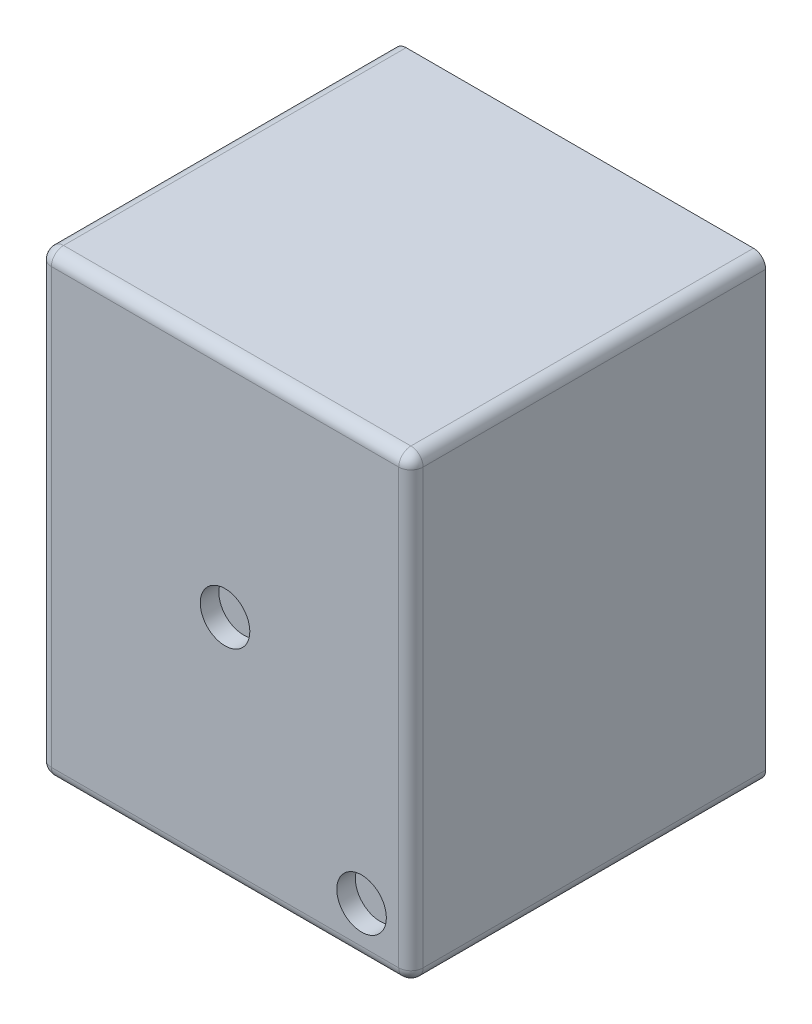
ISO-10303-21;
HEADER;
FILE_DESCRIPTION(('STEP AP214'),'2;1');
FILE_NAME('part.step','',(''),(''),'','','');
FILE_SCHEMA(('AUTOMOTIVE_DESIGN { 1 0 10303 214 1 1 1 1 }'));
ENDSEC;
DATA;
#1=APPLICATION_CONTEXT('core data for automotive mechanical design processes');
#2=APPLICATION_PROTOCOL_DEFINITION('international standard','automotive_design',2000,#1);
#3=PRODUCT_CONTEXT('',#1,'mechanical');
#4=PRODUCT('Part','Part','',(#3));
#5=PRODUCT_RELATED_PRODUCT_CATEGORY('part','',(#4));
#6=PRODUCT_DEFINITION_FORMATION('','',#4);
#7=PRODUCT_DEFINITION_CONTEXT('part definition',#1,'design');
#8=PRODUCT_DEFINITION('design','',#6,#7);
#9=PRODUCT_DEFINITION_SHAPE('','',#8);
#10=(LENGTH_UNIT() NAMED_UNIT(*) SI_UNIT(.MILLI.,.METRE.));
#11=(NAMED_UNIT(*) PLANE_ANGLE_UNIT() SI_UNIT($,.RADIAN.));
#12=(NAMED_UNIT(*) SI_UNIT($,.STERADIAN.) SOLID_ANGLE_UNIT());
#13=UNCERTAINTY_MEASURE_WITH_UNIT(LENGTH_MEASURE(1.E-05),#10,'distance_accuracy_value','');
#14=(GEOMETRIC_REPRESENTATION_CONTEXT(3) GLOBAL_UNCERTAINTY_ASSIGNED_CONTEXT((#13)) GLOBAL_UNIT_ASSIGNED_CONTEXT((#10,
#11,#12)) REPRESENTATION_CONTEXT('',''));
#15=CARTESIAN_POINT('',(0.,0.,0.));
#16=DIRECTION('',(0.,0.,1.));
#17=DIRECTION('',(1.,0.,0.));
#18=AXIS2_PLACEMENT_3D('',#15,#16,#17);
#19=CARTESIAN_POINT('',(-0.997364285309382,0.168780356945077,0.617807641667743));
#20=DIRECTION('',(0.,0.,1.));
#21=DIRECTION('',(1.,0.,0.));
#22=AXIS2_PLACEMENT_3D('',#19,#20,#21);
#23=PLANE('',#22);
#24=CARTESIAN_POINT('',(-0.997364285309382,0.168780356945077,0.617807641667743));
#25=DIRECTION('',(0.,0.,1.));
#26=DIRECTION('',(1.,0.,0.));
#27=AXIS2_PLACEMENT_3D('',#24,#25,#26);
#28=CIRCLE('',#27,0.04);
#29=CARTESIAN_POINT('',(-0.957364285309382,0.168780356945077,0.617807641667743));
#30=VERTEX_POINT('',#29);
#31=EDGE_CURVE('E20',#30,#30,#28,.T.);
#32=ORIENTED_EDGE('',*,*,#31,.T.);
#33=EDGE_LOOP('',(#32));
#34=FACE_BOUND('',#33,.T.);
#35=ADVANCED_FACE('F17',(#34),#23,.T.);
#36=CARTESIAN_POINT('',(-0.776920242454084,-0.121368087614107,0.617807641667743));
#37=DIRECTION('',(0.,0.,1.));
#38=DIRECTION('',(1.,0.,0.));
#39=AXIS2_PLACEMENT_3D('',#36,#37,#38);
#40=PLANE('',#39);
#41=CARTESIAN_POINT('',(-0.776920242454084,-0.121368087614107,0.617807641667743));
#42=DIRECTION('',(0.,0.,1.));
#43=DIRECTION('',(1.,0.,0.));
#44=AXIS2_PLACEMENT_3D('',#41,#42,#43);
#45=CIRCLE('',#44,0.04);
#46=CARTESIAN_POINT('',(-0.736920242454084,-0.121368087614107,0.617807641667743));
#47=VERTEX_POINT('',#46);
#48=EDGE_CURVE('E175',#47,#47,#45,.T.);
#49=ORIENTED_EDGE('',*,*,#48,.T.);
#50=EDGE_LOOP('',(#49));
#51=FACE_BOUND('',#50,.T.);
#52=ADVANCED_FACE('F187',(#51),#40,.T.);
#53=CARTESIAN_POINT('',(-0.997364285309382,0.168780356945077,0.647807641667743));
#54=DIRECTION('',(0.,0.,1.));
#55=DIRECTION('',(1.,0.,0.));
#56=AXIS2_PLACEMENT_3D('',#53,#54,#55);
#57=CYLINDRICAL_SURFACE('',#56,0.04);
#58=ORIENTED_EDGE('',*,*,#31,.F.);
#59=EDGE_LOOP('',(#58));
#60=FACE_BOUND('',#59,.T.);
#61=CARTESIAN_POINT('',(-0.997364285309382,0.168780356945077,0.647807641667743));
#62=DIRECTION('',(0.,0.,1.));
#63=DIRECTION('',(1.,0.,0.));
#64=AXIS2_PLACEMENT_3D('',#61,#62,#63);
#65=CIRCLE('',#64,0.04);
#66=CARTESIAN_POINT('',(-0.957364285309382,0.168780356945077,0.647807641667743));
#67=VERTEX_POINT('',#66);
#68=EDGE_CURVE('E173',#67,#67,#65,.T.);
#69=ORIENTED_EDGE('',*,*,#68,.T.);
#70=EDGE_LOOP('',(#69));
#71=FACE_BOUND('',#70,.T.);
#72=ADVANCED_FACE('F183',(#60,#71),#57,.F.);
#73=CARTESIAN_POINT('',(-0.776920242454084,-0.121368087614107,0.647807641667743));
#74=DIRECTION('',(0.,0.,1.));
#75=DIRECTION('',(1.,0.,0.));
#76=AXIS2_PLACEMENT_3D('',#73,#74,#75);
#77=CYLINDRICAL_SURFACE('',#76,0.04);
#78=ORIENTED_EDGE('',*,*,#48,.F.);
#79=EDGE_LOOP('',(#78));
#80=FACE_BOUND('',#79,.T.);
#81=CARTESIAN_POINT('',(-0.776920242454084,-0.121368087614107,0.647807641667743));
#82=DIRECTION('',(0.,0.,1.));
#83=DIRECTION('',(1.,0.,0.));
#84=AXIS2_PLACEMENT_3D('',#81,#82,#83);
#85=CIRCLE('',#84,0.04);
#86=CARTESIAN_POINT('',(-0.736920242454084,-0.121368087614107,0.647807641667743));
#87=VERTEX_POINT('',#86);
#88=EDGE_CURVE('E139',#87,#87,#85,.T.);
#89=ORIENTED_EDGE('',*,*,#88,.T.);
#90=EDGE_LOOP('',(#89));
#91=FACE_BOUND('',#90,.T.);
#92=ADVANCED_FACE('F186',(#80,#91),#77,.F.);
#93=CARTESIAN_POINT('',(-1.30585273245021,0.55394364596018,0.647807641667743));
#94=DIRECTION('',(0.,0.,-1.));
#95=DIRECTION('',(-1.,0.,0.));
#96=AXIS2_PLACEMENT_3D('',#93,#94,#95);
#97=PLANE('',#96);
#98=DIRECTION('',(0.,-1.,0.));
#99=VECTOR('',#98,1.);
#100=CARTESIAN_POINT('',(-0.716920242454083,-0.216382932070025,0.647807641667743));
#101=LINE('',#100,#99);
#102=CARTESIAN_POINT('',(-0.716920242454083,0.518928801504261,0.647807641667743));
#103=VERTEX_POINT('',#102);
#104=CARTESIAN_POINT('',(-0.716920242454084,-0.181368087614107,0.647807641667743));
#105=VERTEX_POINT('',#104);
#106=EDGE_CURVE('E132',#103,#105,#101,.T.);
#107=ORIENTED_EDGE('',*,*,#106,.F.);
#108=DIRECTION('',(1.,0.,0.));
#109=VECTOR('',#108,1.);
#110=CARTESIAN_POINT('',(-0.688875838168554,0.518928801504262,0.647807641667743));
#111=LINE('',#110,#109);
#112=CARTESIAN_POINT('',(-1.27780832816468,0.518928801504262,0.647807641667743));
#113=VERTEX_POINT('',#112);
#114=EDGE_CURVE('E126',#113,#103,#111,.T.);
#115=ORIENTED_EDGE('',*,*,#114,.F.);
#116=DIRECTION('',(0.,1.,0.));
#117=VECTOR('',#116,1.);
#118=CARTESIAN_POINT('',(-1.27780832816468,0.55394364596018,0.647807641667743));
#119=LINE('',#118,#117);
#120=CARTESIAN_POINT('',(-1.27780832816468,-0.181368087614107,0.647807641667743));
#121=VERTEX_POINT('',#120);
#122=EDGE_CURVE('E155',#121,#113,#119,.T.);
#123=ORIENTED_EDGE('',*,*,#122,.F.);
#124=DIRECTION('',(-1.,0.,0.));
#125=VECTOR('',#124,1.);
#126=CARTESIAN_POINT('',(-1.30585273245021,-0.181368087614107,0.647807641667743));
#127=LINE('',#126,#125);
#128=EDGE_CURVE('E131',#105,#121,#127,.T.);
#129=ORIENTED_EDGE('',*,*,#128,.F.);
#130=EDGE_LOOP('',(#107,#115,#123,#129));
#131=FACE_BOUND('',#130,.T.);
#132=ORIENTED_EDGE('',*,*,#88,.F.);
#133=EDGE_LOOP('',(#132));
#134=FACE_BOUND('',#133,.T.);
#135=ORIENTED_EDGE('',*,*,#68,.F.);
#136=EDGE_LOOP('',(#135));
#137=FACE_BOUND('',#136,.T.);
#138=ADVANCED_FACE('F135',(#131,#134,#137),#97,.F.);
#139=CARTESIAN_POINT('',(-1.30585273245021,-0.181368087614107,0.628135510520202));
#140=DIRECTION('',(-1.,0.,0.));
#141=DIRECTION('',(0.,-1.,0.));
#142=AXIS2_PLACEMENT_3D('',#139,#140,#141);
#143=CYLINDRICAL_SURFACE('',#142,0.019672131147541);
#144=DIRECTION('',(1.,0.,0.));
#145=VECTOR('',#144,1.);
#146=CARTESIAN_POINT('',(-1.29748045931222,-0.201040218761648,0.628135510520202));
#147=LINE('',#146,#145);
#148=CARTESIAN_POINT('',(-0.716920242454084,-0.201040218761648,0.628135510520202));
#149=VERTEX_POINT('',#148);
#150=CARTESIAN_POINT('',(-1.27780832816468,-0.201040218761648,0.628135510520202));
#151=VERTEX_POINT('',#150);
#152=EDGE_CURVE('E293',#149,#151,#147,.F.);
#153=ORIENTED_EDGE('',*,*,#152,.F.);
#154=CARTESIAN_POINT('',(-0.716920242454084,-0.181368087614107,0.628135510520202));
#155=DIRECTION('',(-1.,0.,0.));
#156=DIRECTION('',(0.,-1.,0.));
#157=AXIS2_PLACEMENT_3D('',#154,#155,#156);
#158=CIRCLE('',#157,0.019672131147541);
#159=EDGE_CURVE('E147',#105,#149,#158,.F.);
#160=ORIENTED_EDGE('',*,*,#159,.F.);
#161=ORIENTED_EDGE('',*,*,#128,.T.);
#162=CARTESIAN_POINT('',(-1.27780832816468,-0.181368087614107,0.628135510520202));
#163=DIRECTION('',(-1.,0.,0.));
#164=DIRECTION('',(0.,-1.,0.));
#165=AXIS2_PLACEMENT_3D('',#162,#163,#164);
#166=CIRCLE('',#165,0.019672131147541);
#167=EDGE_CURVE('E260',#151,#121,#166,.T.);
#168=ORIENTED_EDGE('',*,*,#167,.F.);
#169=EDGE_LOOP('',(#153,#160,#161,#168));
#170=FACE_BOUND('',#169,.T.);
#171=ADVANCED_FACE('F192',(#170),#143,.T.);
#172=CARTESIAN_POINT('',(-0.716920242454084,-0.181368087614107,0.628135510520202));
#173=DIRECTION('',(0.,-1.,0.));
#174=DIRECTION('',(0.,0.,1.));
#175=AXIS2_PLACEMENT_3D('',#172,#173,#174);
#176=SPHERICAL_SURFACE('',#175,0.019672131147541);
#177=CARTESIAN_POINT('',(-0.716920242454084,-0.181368087614107,0.628135510520202));
#178=DIRECTION('',(0.,-1.,0.));
#179=DIRECTION('',(1.,0.,0.));
#180=AXIS2_PLACEMENT_3D('',#177,#178,#179);
#181=CIRCLE('',#180,0.019672131147541);
#182=CARTESIAN_POINT('',(-0.697248111306544,-0.181368087614107,0.628135510520202));
#183=VERTEX_POINT('',#182);
#184=EDGE_CURVE('E106',#105,#183,#181,.F.);
#185=ORIENTED_EDGE('',*,*,#184,.F.);
#186=ORIENTED_EDGE('',*,*,#159,.T.);
#187=CARTESIAN_POINT('',(-0.716920242454084,-0.181368087614107,0.628135510520202));
#188=DIRECTION('',(0.,0.,-1.));
#189=DIRECTION('',(-1.,0.,0.));
#190=AXIS2_PLACEMENT_3D('',#187,#188,#189);
#191=CIRCLE('',#190,0.019672131147541);
#192=EDGE_CURVE('E283',#183,#149,#191,.T.);
#193=ORIENTED_EDGE('',*,*,#192,.F.);
#194=EDGE_LOOP('',(#185,#186,#193));
#195=FACE_BOUND('',#194,.T.);
#196=ADVANCED_FACE('F199',(#195),#176,.T.);
#197=CARTESIAN_POINT('',(-0.716920242454084,-0.216382932070025,0.628135510520202));
#198=DIRECTION('',(0.,-1.,0.));
#199=DIRECTION('',(1.,0.,0.));
#200=AXIS2_PLACEMENT_3D('',#197,#198,#199);
#201=CYLINDRICAL_SURFACE('',#200,0.019672131147541);
#202=DIRECTION('',(0.,1.,0.));
#203=VECTOR('',#202,1.);
#204=CARTESIAN_POINT('',(-0.697248111306544,-0.201040218761648,0.628135510520202));
#205=LINE('',#204,#203);
#206=CARTESIAN_POINT('',(-0.697248111306543,0.518928801504261,0.628135510520202));
#207=VERTEX_POINT('',#206);
#208=EDGE_CURVE('E144',#207,#183,#205,.F.);
#209=ORIENTED_EDGE('',*,*,#208,.F.);
#210=CARTESIAN_POINT('',(-0.716920242454083,0.518928801504261,0.628135510520202));
#211=DIRECTION('',(0.,-1.,0.));
#212=DIRECTION('',(0.,0.,1.));
#213=AXIS2_PLACEMENT_3D('',#210,#211,#212);
#214=CIRCLE('',#213,0.0196721311475411);
#215=EDGE_CURVE('E115',#103,#207,#214,.F.);
#216=ORIENTED_EDGE('',*,*,#215,.F.);
#217=ORIENTED_EDGE('',*,*,#106,.T.);
#218=ORIENTED_EDGE('',*,*,#184,.T.);
#219=EDGE_LOOP('',(#209,#216,#217,#218));
#220=FACE_BOUND('',#219,.T.);
#221=ADVANCED_FACE('F142',(#220),#201,.T.);
#222=CARTESIAN_POINT('',(-0.716920242454083,0.518928801504261,0.628135510520202));
#223=DIRECTION('',(0.,-1.,0.));
#224=DIRECTION('',(0.,0.,1.));
#225=AXIS2_PLACEMENT_3D('',#222,#223,#224);
#226=SPHERICAL_SURFACE('',#225,0.019672131147541);
#227=CARTESIAN_POINT('',(-0.716920242454083,0.518928801504261,0.628135510520202));
#228=DIRECTION('',(1.,0.,0.));
#229=DIRECTION('',(0.,1.,0.));
#230=AXIS2_PLACEMENT_3D('',#227,#228,#229);
#231=CIRCLE('',#230,0.019672131147541);
#232=CARTESIAN_POINT('',(-0.716920242454083,0.538600932651802,0.628135510520202));
#233=VERTEX_POINT('',#232);
#234=EDGE_CURVE('E111',#103,#233,#231,.F.);
#235=ORIENTED_EDGE('',*,*,#234,.F.);
#236=ORIENTED_EDGE('',*,*,#215,.T.);
#237=CARTESIAN_POINT('',(-0.716920242454083,0.518928801504261,0.628135510520202));
#238=DIRECTION('',(0.,0.,-1.));
#239=DIRECTION('',(-1.,0.,0.));
#240=AXIS2_PLACEMENT_3D('',#237,#238,#239);
#241=CIRCLE('',#240,0.019672131147541);
#242=EDGE_CURVE('E117',#233,#207,#241,.T.);
#243=ORIENTED_EDGE('',*,*,#242,.F.);
#244=EDGE_LOOP('',(#235,#236,#243));
#245=FACE_BOUND('',#244,.T.);
#246=ADVANCED_FACE('F113',(#245),#226,.T.);
#247=CARTESIAN_POINT('',(-0.688875838168554,0.518928801504261,0.628135510520202));
#248=DIRECTION('',(1.,0.,0.));
#249=DIRECTION('',(0.,1.,0.));
#250=AXIS2_PLACEMENT_3D('',#247,#248,#249);
#251=CYLINDRICAL_SURFACE('',#250,0.019672131147541);
#252=DIRECTION('',(-1.,0.,0.));
#253=VECTOR('',#252,1.);
#254=CARTESIAN_POINT('',(-0.697248111306544,0.538600932651802,0.628135510520202));
#255=LINE('',#254,#253);
#256=CARTESIAN_POINT('',(-1.27780832816468,0.538600932651803,0.628135510520202));
#257=VERTEX_POINT('',#256);
#258=EDGE_CURVE('E265',#257,#233,#255,.F.);
#259=ORIENTED_EDGE('',*,*,#258,.F.);
#260=CARTESIAN_POINT('',(-1.27780832816468,0.518928801504262,0.628135510520202));
#261=DIRECTION('',(-1.,0.,0.));
#262=DIRECTION('',(0.,-1.,0.));
#263=AXIS2_PLACEMENT_3D('',#260,#261,#262);
#264=CIRCLE('',#263,0.019672131147541);
#265=EDGE_CURVE('E122',#113,#257,#264,.T.);
#266=ORIENTED_EDGE('',*,*,#265,.F.);
#267=ORIENTED_EDGE('',*,*,#114,.T.);
#268=ORIENTED_EDGE('',*,*,#234,.T.);
#269=EDGE_LOOP('',(#259,#266,#267,#268));
#270=FACE_BOUND('',#269,.T.);
#271=ADVANCED_FACE('F128',(#270),#251,.T.);
#272=CARTESIAN_POINT('',(-1.27780832816468,0.518928801504262,0.628135510520202));
#273=DIRECTION('',(0.,-1.,0.));
#274=DIRECTION('',(0.,0.,1.));
#275=AXIS2_PLACEMENT_3D('',#272,#273,#274);
#276=SPHERICAL_SURFACE('',#275,0.019672131147541);
#277=CARTESIAN_POINT('',(-1.27780832816468,0.518928801504262,0.628135510520202));
#278=DIRECTION('',(0.,1.,0.));
#279=DIRECTION('',(-1.,0.,0.));
#280=AXIS2_PLACEMENT_3D('',#277,#278,#279);
#281=CIRCLE('',#280,0.019672131147541);
#282=CARTESIAN_POINT('',(-1.29748045931222,0.518928801504262,0.628135510520202));
#283=VERTEX_POINT('',#282);
#284=EDGE_CURVE('E258',#113,#283,#281,.F.);
#285=ORIENTED_EDGE('',*,*,#284,.F.);
#286=ORIENTED_EDGE('',*,*,#265,.T.);
#287=CARTESIAN_POINT('',(-1.27780832816468,0.518928801504262,0.628135510520202));
#288=DIRECTION('',(0.,0.,-1.));
#289=DIRECTION('',(-1.,0.,0.));
#290=AXIS2_PLACEMENT_3D('',#287,#288,#289);
#291=CIRCLE('',#290,0.019672131147541);
#292=EDGE_CURVE('E251',#283,#257,#291,.T.);
#293=ORIENTED_EDGE('',*,*,#292,.F.);
#294=EDGE_LOOP('',(#285,#286,#293));
#295=FACE_BOUND('',#294,.T.);
#296=ADVANCED_FACE('F267',(#295),#276,.T.);
#297=CARTESIAN_POINT('',(-1.27780832816468,0.55394364596018,0.628135510520202));
#298=DIRECTION('',(0.,1.,0.));
#299=DIRECTION('',(-1.,0.,0.));
#300=AXIS2_PLACEMENT_3D('',#297,#298,#299);
#301=CYLINDRICAL_SURFACE('',#300,0.019672131147541);
#302=DIRECTION('',(0.,-1.,0.));
#303=VECTOR('',#302,1.);
#304=CARTESIAN_POINT('',(-1.29748045931222,0.538600932651803,0.628135510520202));
#305=LINE('',#304,#303);
#306=CARTESIAN_POINT('',(-1.29748045931222,-0.181368087614107,0.628135510520202));
#307=VERTEX_POINT('',#306);
#308=EDGE_CURVE('E254',#307,#283,#305,.F.);
#309=ORIENTED_EDGE('',*,*,#308,.F.);
#310=CARTESIAN_POINT('',(-1.27780832816468,-0.181368087614107,0.628135510520202));
#311=DIRECTION('',(0.,-1.,0.));
#312=DIRECTION('',(0.,0.,1.));
#313=AXIS2_PLACEMENT_3D('',#310,#311,#312);
#314=CIRCLE('',#313,0.0196721311475411);
#315=EDGE_CURVE('E75',#121,#307,#314,.T.);
#316=ORIENTED_EDGE('',*,*,#315,.F.);
#317=ORIENTED_EDGE('',*,*,#122,.T.);
#318=ORIENTED_EDGE('',*,*,#284,.T.);
#319=EDGE_LOOP('',(#309,#316,#317,#318));
#320=FACE_BOUND('',#319,.T.);
#321=ADVANCED_FACE('F244',(#320),#301,.T.);
#322=CARTESIAN_POINT('',(-1.27780832816468,-0.181368087614107,0.628135510520202));
#323=DIRECTION('',(0.,-1.,0.));
#324=DIRECTION('',(0.,0.,1.));
#325=AXIS2_PLACEMENT_3D('',#322,#323,#324);
#326=SPHERICAL_SURFACE('',#325,0.019672131147541);
#327=ORIENTED_EDGE('',*,*,#167,.T.);
#328=ORIENTED_EDGE('',*,*,#315,.T.);
#329=CARTESIAN_POINT('',(-1.27780832816468,-0.181368087614107,0.628135510520202));
#330=DIRECTION('',(0.,0.,-1.));
#331=DIRECTION('',(-1.,0.,0.));
#332=AXIS2_PLACEMENT_3D('',#329,#330,#331);
#333=CIRCLE('',#332,0.019672131147541);
#334=EDGE_CURVE('E515',#151,#307,#333,.T.);
#335=ORIENTED_EDGE('',*,*,#334,.F.);
#336=EDGE_LOOP('',(#327,#328,#335));
#337=FACE_BOUND('',#336,.T.);
#338=ADVANCED_FACE('F240',(#337),#326,.T.);
#339=CARTESIAN_POINT('',(-1.29748045931222,-0.201040218761648,0.0553202271847168));
#340=DIRECTION('',(0.,-1.,0.));
#341=DIRECTION('',(1.,0.,0.));
#342=AXIS2_PLACEMENT_3D('',#339,#340,#341);
#343=PLANE('',#342);
#344=DIRECTION('',(0.,0.,1.));
#345=VECTOR('',#344,1.);
#346=CARTESIAN_POINT('',(-1.27780832816468,-0.201040218761648,0.0553202271847168));
#347=LINE('',#346,#345);
#348=CARTESIAN_POINT('',(-1.27780832816468,-0.201040218761648,0.0749923583322578));
#349=VERTEX_POINT('',#348);
#350=EDGE_CURVE('E67',#151,#349,#347,.F.);
#351=ORIENTED_EDGE('',*,*,#350,.T.);
#352=DIRECTION('',(1.,0.,0.));
#353=VECTOR('',#352,1.);
#354=CARTESIAN_POINT('',(-0.997364285309383,-0.201040218761648,0.0749923583322578));
#355=LINE('',#354,#353);
#356=CARTESIAN_POINT('',(-0.716920242454084,-0.201040218761648,0.0749923583322578));
#357=VERTEX_POINT('',#356);
#358=EDGE_CURVE('E168',#349,#357,#355,.T.);
#359=ORIENTED_EDGE('',*,*,#358,.T.);
#360=DIRECTION('',(0.,0.,-1.));
#361=VECTOR('',#360,1.);
#362=CARTESIAN_POINT('',(-0.716920242454084,-0.201040218761648,0.0553202271847168));
#363=LINE('',#362,#361);
#364=EDGE_CURVE('E59',#149,#357,#363,.T.);
#365=ORIENTED_EDGE('',*,*,#364,.F.);
#366=ORIENTED_EDGE('',*,*,#152,.T.);
#367=EDGE_LOOP('',(#351,#359,#365,#366));
#368=FACE_BOUND('',#367,.T.);
#369=ADVANCED_FACE('F237',(#368),#343,.T.);
#370=CARTESIAN_POINT('',(-0.716920242454084,-0.181368087614107,0.0553202271847168));
#371=DIRECTION('',(0.,0.,-1.));
#372=DIRECTION('',(-1.,0.,0.));
#373=AXIS2_PLACEMENT_3D('',#370,#371,#372);
#374=CYLINDRICAL_SURFACE('',#373,0.019672131147541);
#375=DIRECTION('',(0.,0.,1.));
#376=VECTOR('',#375,1.);
#377=CARTESIAN_POINT('',(-0.697248111306544,-0.181368087614107,0.0553202271847168));
#378=LINE('',#377,#376);
#379=CARTESIAN_POINT('',(-0.697248111306544,-0.181368087614107,0.0749923583322578));
#380=VERTEX_POINT('',#379);
#381=EDGE_CURVE('E282',#183,#380,#378,.F.);
#382=ORIENTED_EDGE('',*,*,#381,.F.);
#383=ORIENTED_EDGE('',*,*,#192,.T.);
#384=ORIENTED_EDGE('',*,*,#364,.T.);
#385=CARTESIAN_POINT('',(-0.716920242454084,-0.181368087614107,0.0749923583322578));
#386=DIRECTION('',(0.,0.,-1.));
#387=DIRECTION('',(-1.,0.,0.));
#388=AXIS2_PLACEMENT_3D('',#385,#386,#387);
#389=CIRCLE('',#388,0.019672131147541);
#390=EDGE_CURVE('E166',#357,#380,#389,.F.);
#391=ORIENTED_EDGE('',*,*,#390,.T.);
#392=EDGE_LOOP('',(#382,#383,#384,#391));
#393=FACE_BOUND('',#392,.T.);
#394=ADVANCED_FACE('F233',(#393),#374,.T.);
#395=CARTESIAN_POINT('',(-0.697248111306544,-0.201040218761648,0.0553202271847168));
#396=DIRECTION('',(1.,0.,0.));
#397=DIRECTION('',(0.,1.,0.));
#398=AXIS2_PLACEMENT_3D('',#395,#396,#397);
#399=PLANE('',#398);
#400=ORIENTED_EDGE('',*,*,#208,.T.);
#401=ORIENTED_EDGE('',*,*,#381,.T.);
#402=DIRECTION('',(0.,1.,0.));
#403=VECTOR('',#402,1.);
#404=CARTESIAN_POINT('',(-0.697248111306544,0.168780356945077,0.0749923583322578));
#405=LINE('',#404,#403);
#406=CARTESIAN_POINT('',(-0.697248111306543,0.518928801504261,0.0749923583322578));
#407=VERTEX_POINT('',#406);
#408=EDGE_CURVE('E165',#380,#407,#405,.T.);
#409=ORIENTED_EDGE('',*,*,#408,.T.);
#410=DIRECTION('',(0.,0.,-1.));
#411=VECTOR('',#410,1.);
#412=CARTESIAN_POINT('',(-0.697248111306542,0.518928801504261,0.0553202271847168));
#413=LINE('',#412,#411);
#414=EDGE_CURVE('E533',#207,#407,#413,.T.);
#415=ORIENTED_EDGE('',*,*,#414,.F.);
#416=EDGE_LOOP('',(#400,#401,#409,#415));
#417=FACE_BOUND('',#416,.T.);
#418=ADVANCED_FACE('F229',(#417),#399,.T.);
#419=CARTESIAN_POINT('',(-0.716920242454083,0.518928801504261,0.0553202271847168));
#420=DIRECTION('',(0.,0.,-1.));
#421=DIRECTION('',(-1.,0.,0.));
#422=AXIS2_PLACEMENT_3D('',#419,#420,#421);
#423=CYLINDRICAL_SURFACE('',#422,0.019672131147541);
#424=DIRECTION('',(0.,0.,1.));
#425=VECTOR('',#424,1.);
#426=CARTESIAN_POINT('',(-0.716920242454083,0.538600932651802,0.0553202271847168));
#427=LINE('',#426,#425);
#428=CARTESIAN_POINT('',(-0.716920242454083,0.538600932651802,0.0749923583322578));
#429=VERTEX_POINT('',#428);
#430=EDGE_CURVE('E526',#233,#429,#427,.F.);
#431=ORIENTED_EDGE('',*,*,#430,.F.);
#432=ORIENTED_EDGE('',*,*,#242,.T.);
#433=ORIENTED_EDGE('',*,*,#414,.T.);
#434=CARTESIAN_POINT('',(-0.716920242454083,0.518928801504261,0.0749923583322578));
#435=DIRECTION('',(0.,0.,-1.));
#436=DIRECTION('',(-1.,0.,0.));
#437=AXIS2_PLACEMENT_3D('',#434,#435,#436);
#438=CIRCLE('',#437,0.019672131147541);
#439=EDGE_CURVE('E163',#407,#429,#438,.F.);
#440=ORIENTED_EDGE('',*,*,#439,.T.);
#441=EDGE_LOOP('',(#431,#432,#433,#440));
#442=FACE_BOUND('',#441,.T.);
#443=ADVANCED_FACE('F225',(#442),#423,.T.);
#444=CARTESIAN_POINT('',(-0.697248111306544,0.538600932651802,0.0553202271847168));
#445=DIRECTION('',(0.,1.,0.));
#446=DIRECTION('',(-1.,0.,0.));
#447=AXIS2_PLACEMENT_3D('',#444,#445,#446);
#448=PLANE('',#447);
#449=ORIENTED_EDGE('',*,*,#258,.T.);
#450=ORIENTED_EDGE('',*,*,#430,.T.);
#451=DIRECTION('',(1.,0.,0.));
#452=VECTOR('',#451,1.);
#453=CARTESIAN_POINT('',(-0.997364285309383,0.538600932651802,0.0749923583322578));
#454=LINE('',#453,#452);
#455=CARTESIAN_POINT('',(-1.27780832816468,0.538600932651803,0.0749923583322578));
#456=VERTEX_POINT('',#455);
#457=EDGE_CURVE('E162',#429,#456,#454,.F.);
#458=ORIENTED_EDGE('',*,*,#457,.T.);
#459=DIRECTION('',(0.,0.,-1.));
#460=VECTOR('',#459,1.);
#461=CARTESIAN_POINT('',(-1.27780832816468,0.538600932651803,0.0553202271847168));
#462=LINE('',#461,#460);
#463=EDGE_CURVE('E255',#257,#456,#462,.T.);
#464=ORIENTED_EDGE('',*,*,#463,.F.);
#465=EDGE_LOOP('',(#449,#450,#458,#464));
#466=FACE_BOUND('',#465,.T.);
#467=ADVANCED_FACE('F221',(#466),#448,.T.);
#468=CARTESIAN_POINT('',(-1.27780832816468,0.518928801504262,0.0553202271847168));
#469=DIRECTION('',(0.,0.,-1.));
#470=DIRECTION('',(-1.,0.,0.));
#471=AXIS2_PLACEMENT_3D('',#468,#469,#470);
#472=CYLINDRICAL_SURFACE('',#471,0.019672131147541);
#473=DIRECTION('',(0.,0.,1.));
#474=VECTOR('',#473,1.);
#475=CARTESIAN_POINT('',(-1.29748045931222,0.518928801504262,0.0553202271847168));
#476=LINE('',#475,#474);
#477=CARTESIAN_POINT('',(-1.29748045931222,0.518928801504262,0.0749923583322578));
#478=VERTEX_POINT('',#477);
#479=EDGE_CURVE('E513',#283,#478,#476,.F.);
#480=ORIENTED_EDGE('',*,*,#479,.F.);
#481=ORIENTED_EDGE('',*,*,#292,.T.);
#482=ORIENTED_EDGE('',*,*,#463,.T.);
#483=CARTESIAN_POINT('',(-1.27780832816468,0.518928801504262,0.0749923583322578));
#484=DIRECTION('',(0.,0.,-1.));
#485=DIRECTION('',(-1.,0.,0.));
#486=AXIS2_PLACEMENT_3D('',#483,#484,#485);
#487=CIRCLE('',#486,0.019672131147541);
#488=EDGE_CURVE('E26',#456,#478,#487,.F.);
#489=ORIENTED_EDGE('',*,*,#488,.T.);
#490=EDGE_LOOP('',(#480,#481,#482,#489));
#491=FACE_BOUND('',#490,.T.);
#492=ADVANCED_FACE('F217',(#491),#472,.T.);
#493=CARTESIAN_POINT('',(-1.29748045931222,0.538600932651803,0.0553202271847168));
#494=DIRECTION('',(-1.,0.,0.));
#495=DIRECTION('',(0.,-1.,0.));
#496=AXIS2_PLACEMENT_3D('',#493,#494,#495);
#497=PLANE('',#496);
#498=ORIENTED_EDGE('',*,*,#308,.T.);
#499=ORIENTED_EDGE('',*,*,#479,.T.);
#500=DIRECTION('',(0.,1.,0.));
#501=VECTOR('',#500,1.);
#502=CARTESIAN_POINT('',(-1.29748045931222,0.168780356945077,0.0749923583322578));
#503=LINE('',#502,#501);
#504=CARTESIAN_POINT('',(-1.29748045931222,-0.181368087614107,0.0749923583322578));
#505=VERTEX_POINT('',#504);
#506=EDGE_CURVE('E11',#478,#505,#503,.F.);
#507=ORIENTED_EDGE('',*,*,#506,.T.);
#508=DIRECTION('',(0.,0.,-1.));
#509=VECTOR('',#508,1.);
#510=CARTESIAN_POINT('',(-1.29748045931222,-0.181368087614107,0.0553202271847168));
#511=LINE('',#510,#509);
#512=EDGE_CURVE('E170',#307,#505,#511,.T.);
#513=ORIENTED_EDGE('',*,*,#512,.F.);
#514=EDGE_LOOP('',(#498,#499,#507,#513));
#515=FACE_BOUND('',#514,.T.);
#516=ADVANCED_FACE('F211',(#515),#497,.T.);
#517=CARTESIAN_POINT('',(-1.27780832816468,-0.181368087614107,0.0553202271847168));
#518=DIRECTION('',(0.,0.,-1.));
#519=DIRECTION('',(-1.,0.,0.));
#520=AXIS2_PLACEMENT_3D('',#517,#518,#519);
#521=CYLINDRICAL_SURFACE('',#520,0.019672131147541);
#522=ORIENTED_EDGE('',*,*,#512,.T.);
#523=CARTESIAN_POINT('',(-1.27780832816468,-0.181368087614107,0.0749923583322578));
#524=DIRECTION('',(0.,0.,-1.));
#525=DIRECTION('',(-1.,0.,0.));
#526=AXIS2_PLACEMENT_3D('',#523,#524,#525);
#527=CIRCLE('',#526,0.019672131147541);
#528=EDGE_CURVE('E35',#505,#349,#527,.F.);
#529=ORIENTED_EDGE('',*,*,#528,.T.);
#530=ORIENTED_EDGE('',*,*,#350,.F.);
#531=ORIENTED_EDGE('',*,*,#334,.T.);
#532=EDGE_LOOP('',(#522,#529,#530,#531));
#533=FACE_BOUND('',#532,.T.);
#534=ADVANCED_FACE('F206',(#533),#521,.T.);
#535=CARTESIAN_POINT('',(-0.997364285309383,0.168780356945077,0.0749923583322578));
#536=DIRECTION('',(0.,0.,1.));
#537=DIRECTION('',(1.,0.,0.));
#538=AXIS2_PLACEMENT_3D('',#535,#536,#537);
#539=PLANE('',#538);
#540=ORIENTED_EDGE('',*,*,#506,.F.);
#541=ORIENTED_EDGE('',*,*,#488,.F.);
#542=ORIENTED_EDGE('',*,*,#457,.F.);
#543=ORIENTED_EDGE('',*,*,#439,.F.);
#544=ORIENTED_EDGE('',*,*,#408,.F.);
#545=ORIENTED_EDGE('',*,*,#390,.F.);
#546=ORIENTED_EDGE('',*,*,#358,.F.);
#547=ORIENTED_EDGE('',*,*,#528,.F.);
#548=EDGE_LOOP('',(#540,#541,#542,#543,#544,#545,#546,#547));
#549=FACE_BOUND('',#548,.T.);
#550=ADVANCED_FACE('F204',(#549),#539,.F.);
#551=CLOSED_SHELL('',(#35,#52,#72,#92,#138,#171,#196,#221,#246,#271,#296,#321,#338,#369,#394,
#418,#443,#467,#492,#516,#534,#550));
#552=MANIFOLD_SOLID_BREP('B1',#551);
#553=ADVANCED_BREP_SHAPE_REPRESENTATION('',(#18,#552),#14);
#554=SHAPE_DEFINITION_REPRESENTATION(#9,#553);
ENDSEC;
END-ISO-10303-21;
